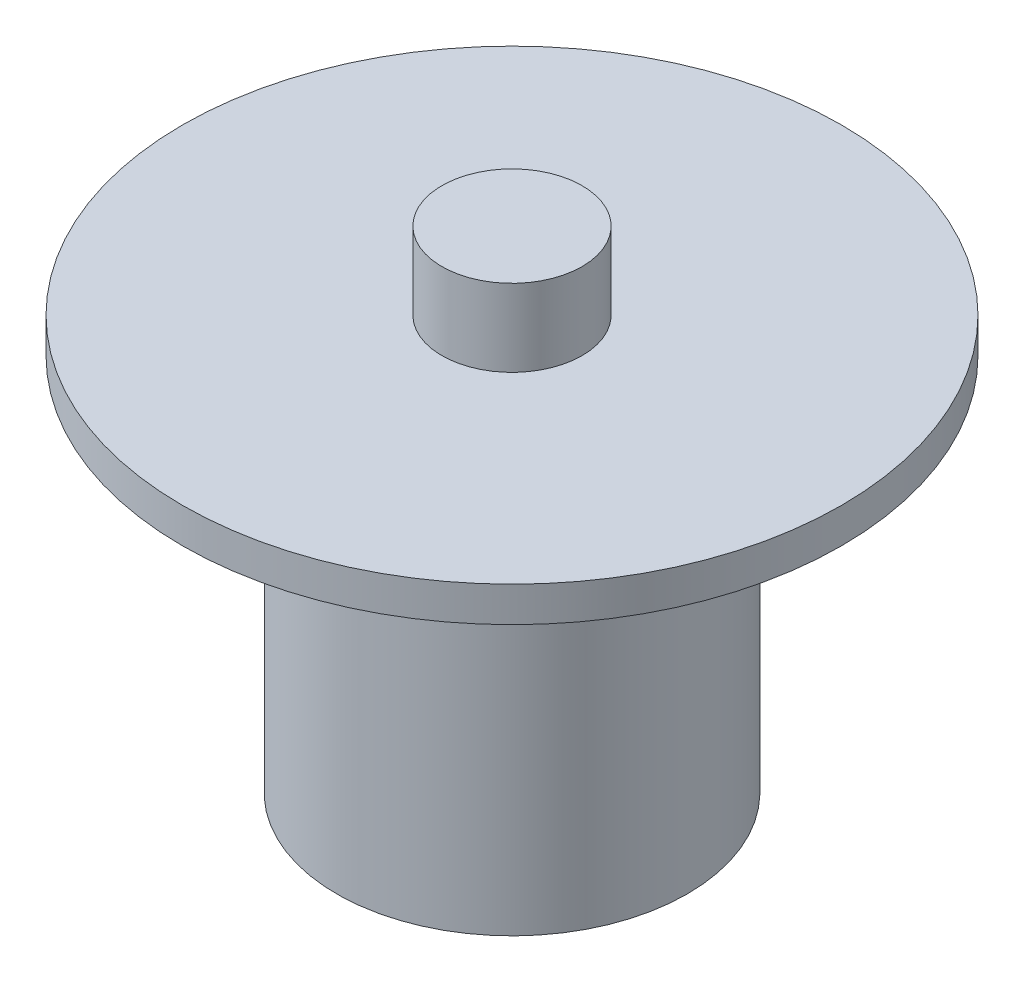
ISO-10303-21;
HEADER;
FILE_DESCRIPTION(('STEP AP214'),'2;1');
FILE_NAME('part.step','',(''),(''),'','','');
FILE_SCHEMA(('AUTOMOTIVE_DESIGN { 1 0 10303 214 1 1 1 1 }'));
ENDSEC;
DATA;
#1=APPLICATION_CONTEXT('core data for automotive mechanical design processes');
#2=APPLICATION_PROTOCOL_DEFINITION('international standard','automotive_design',2000,#1);
#3=PRODUCT_CONTEXT('',#1,'mechanical');
#4=PRODUCT('Part','Part','',(#3));
#5=PRODUCT_RELATED_PRODUCT_CATEGORY('part','',(#4));
#6=PRODUCT_DEFINITION_FORMATION('','',#4);
#7=PRODUCT_DEFINITION_CONTEXT('part definition',#1,'design');
#8=PRODUCT_DEFINITION('design','',#6,#7);
#9=PRODUCT_DEFINITION_SHAPE('','',#8);
#10=(LENGTH_UNIT() NAMED_UNIT(*) SI_UNIT(.MILLI.,.METRE.));
#11=(NAMED_UNIT(*) PLANE_ANGLE_UNIT() SI_UNIT($,.RADIAN.));
#12=(NAMED_UNIT(*) SI_UNIT($,.STERADIAN.) SOLID_ANGLE_UNIT());
#13=UNCERTAINTY_MEASURE_WITH_UNIT(LENGTH_MEASURE(1.E-05),#10,'distance_accuracy_value','');
#14=(GEOMETRIC_REPRESENTATION_CONTEXT(3) GLOBAL_UNCERTAINTY_ASSIGNED_CONTEXT((#13)) GLOBAL_UNIT_ASSIGNED_CONTEXT((#10,
#11,#12)) REPRESENTATION_CONTEXT('',''));
#15=CARTESIAN_POINT('',(0.,0.,0.));
#16=DIRECTION('',(0.,0.,1.));
#17=DIRECTION('',(1.,0.,0.));
#18=AXIS2_PLACEMENT_3D('',#15,#16,#17);
#19=CARTESIAN_POINT('',(0.,8.75,0.));
#20=DIRECTION('',(0.,-1.,0.));
#21=DIRECTION('',(1.,0.,0.));
#22=AXIS2_PLACEMENT_3D('',#19,#20,#21);
#23=PLANE('',#22);
#24=CARTESIAN_POINT('',(0.,8.75,0.));
#25=DIRECTION('',(0.,-1.,0.));
#26=DIRECTION('',(1.,0.,0.));
#27=AXIS2_PLACEMENT_3D('',#24,#25,#26);
#28=CIRCLE('',#27,2.5);
#29=CARTESIAN_POINT('',(2.5,8.75,0.));
#30=VERTEX_POINT('',#29);
#31=EDGE_CURVE('E10',#30,#30,#28,.T.);
#32=ORIENTED_EDGE('',*,*,#31,.F.);
#33=EDGE_LOOP('',(#32));
#34=FACE_BOUND('',#33,.T.);
#35=ADVANCED_FACE('F31',(#34),#23,.F.);
#36=CARTESIAN_POINT('',(0.,-8.75,0.));
#37=DIRECTION('',(0.,-1.,0.));
#38=DIRECTION('',(1.,0.,0.));
#39=AXIS2_PLACEMENT_3D('',#36,#37,#38);
#40=CYLINDRICAL_SURFACE('',#39,2.5);
#41=CARTESIAN_POINT('',(0.,6.,0.));
#42=DIRECTION('',(0.,-1.,0.));
#43=DIRECTION('',(1.,0.,0.));
#44=AXIS2_PLACEMENT_3D('',#41,#42,#43);
#45=CIRCLE('',#44,2.5);
#46=CARTESIAN_POINT('',(2.5,6.,0.));
#47=VERTEX_POINT('',#46);
#48=EDGE_CURVE('E37',#47,#47,#45,.T.);
#49=ORIENTED_EDGE('',*,*,#48,.F.);
#50=EDGE_LOOP('',(#49));
#51=FACE_BOUND('',#50,.T.);
#52=ORIENTED_EDGE('',*,*,#31,.T.);
#53=EDGE_LOOP('',(#52));
#54=FACE_BOUND('',#53,.T.);
#55=ADVANCED_FACE('F79',(#51,#54),#40,.T.);
#56=CARTESIAN_POINT('',(-2.5,6.,0.));
#57=DIRECTION('',(0.,-1.,0.));
#58=DIRECTION('',(1.,0.,0.));
#59=AXIS2_PLACEMENT_3D('',#56,#57,#58);
#60=PLANE('',#59);
#61=CARTESIAN_POINT('',(0.,6.,0.));
#62=DIRECTION('',(0.,-1.,0.));
#63=DIRECTION('',(1.,0.,0.));
#64=AXIS2_PLACEMENT_3D('',#61,#62,#63);
#65=CIRCLE('',#64,11.75);
#66=CARTESIAN_POINT('',(11.75,6.,0.));
#67=VERTEX_POINT('',#66);
#68=EDGE_CURVE('E41',#67,#67,#65,.T.);
#69=ORIENTED_EDGE('',*,*,#68,.F.);
#70=EDGE_LOOP('',(#69));
#71=FACE_BOUND('',#70,.T.);
#72=ORIENTED_EDGE('',*,*,#48,.T.);
#73=EDGE_LOOP('',(#72));
#74=FACE_BOUND('',#73,.T.);
#75=ADVANCED_FACE('F74',(#71,#74),#60,.F.);
#76=CARTESIAN_POINT('',(0.,-8.75,0.));
#77=DIRECTION('',(0.,-1.,0.));
#78=DIRECTION('',(1.,0.,0.));
#79=AXIS2_PLACEMENT_3D('',#76,#77,#78);
#80=CYLINDRICAL_SURFACE('',#79,11.75);
#81=CARTESIAN_POINT('',(0.,4.75,0.));
#82=DIRECTION('',(0.,-1.,0.));
#83=DIRECTION('',(1.,0.,0.));
#84=AXIS2_PLACEMENT_3D('',#81,#82,#83);
#85=CIRCLE('',#84,11.75);
#86=CARTESIAN_POINT('',(11.75,4.75,0.));
#87=VERTEX_POINT('',#86);
#88=EDGE_CURVE('E45',#87,#87,#85,.T.);
#89=ORIENTED_EDGE('',*,*,#88,.F.);
#90=EDGE_LOOP('',(#89));
#91=FACE_BOUND('',#90,.T.);
#92=ORIENTED_EDGE('',*,*,#68,.T.);
#93=EDGE_LOOP('',(#92));
#94=FACE_BOUND('',#93,.T.);
#95=ADVANCED_FACE('F68',(#91,#94),#80,.T.);
#96=CARTESIAN_POINT('',(-11.75,4.75,0.));
#97=DIRECTION('',(0.,1.,0.));
#98=DIRECTION('',(-1.,0.,0.));
#99=AXIS2_PLACEMENT_3D('',#96,#97,#98);
#100=PLANE('',#99);
#101=CARTESIAN_POINT('',(0.,4.75,0.));
#102=DIRECTION('',(0.,-1.,0.));
#103=DIRECTION('',(1.,0.,0.));
#104=AXIS2_PLACEMENT_3D('',#101,#102,#103);
#105=CIRCLE('',#104,6.25);
#106=CARTESIAN_POINT('',(6.25,4.75,0.));
#107=VERTEX_POINT('',#106);
#108=EDGE_CURVE('E50',#107,#107,#105,.T.);
#109=ORIENTED_EDGE('',*,*,#108,.F.);
#110=EDGE_LOOP('',(#109));
#111=FACE_BOUND('',#110,.T.);
#112=ORIENTED_EDGE('',*,*,#88,.T.);
#113=EDGE_LOOP('',(#112));
#114=FACE_BOUND('',#113,.T.);
#115=ADVANCED_FACE('F62',(#111,#114),#100,.F.);
#116=CARTESIAN_POINT('',(0.,-8.75,0.));
#117=DIRECTION('',(0.,-1.,0.));
#118=DIRECTION('',(1.,0.,0.));
#119=AXIS2_PLACEMENT_3D('',#116,#117,#118);
#120=CYLINDRICAL_SURFACE('',#119,6.25);
#121=CARTESIAN_POINT('',(0.,-8.75,0.));
#122=DIRECTION('',(0.,-1.,0.));
#123=DIRECTION('',(1.,0.,0.));
#124=AXIS2_PLACEMENT_3D('',#121,#122,#123);
#125=CIRCLE('',#124,6.25);
#126=CARTESIAN_POINT('',(6.25,-8.75,0.));
#127=VERTEX_POINT('',#126);
#128=EDGE_CURVE('E53',#127,#127,#125,.T.);
#129=ORIENTED_EDGE('',*,*,#128,.F.);
#130=EDGE_LOOP('',(#129));
#131=FACE_BOUND('',#130,.T.);
#132=ORIENTED_EDGE('',*,*,#108,.T.);
#133=EDGE_LOOP('',(#132));
#134=FACE_BOUND('',#133,.T.);
#135=ADVANCED_FACE('F59',(#131,#134),#120,.T.);
#136=CARTESIAN_POINT('',(-6.25,-8.75,0.));
#137=DIRECTION('',(0.,1.,0.));
#138=DIRECTION('',(-1.,0.,0.));
#139=AXIS2_PLACEMENT_3D('',#136,#137,#138);
#140=PLANE('',#139);
#141=ORIENTED_EDGE('',*,*,#128,.T.);
#142=EDGE_LOOP('',(#141));
#143=FACE_BOUND('',#142,.T.);
#144=ADVANCED_FACE('F57',(#143),#140,.F.);
#145=CLOSED_SHELL('',(#35,#55,#75,#95,#115,#135,#144));
#146=MANIFOLD_SOLID_BREP('B2',#145);
#147=ADVANCED_BREP_SHAPE_REPRESENTATION('',(#18,#146),#14);
#148=SHAPE_DEFINITION_REPRESENTATION(#9,#147);
ENDSEC;
END-ISO-10303-21;
